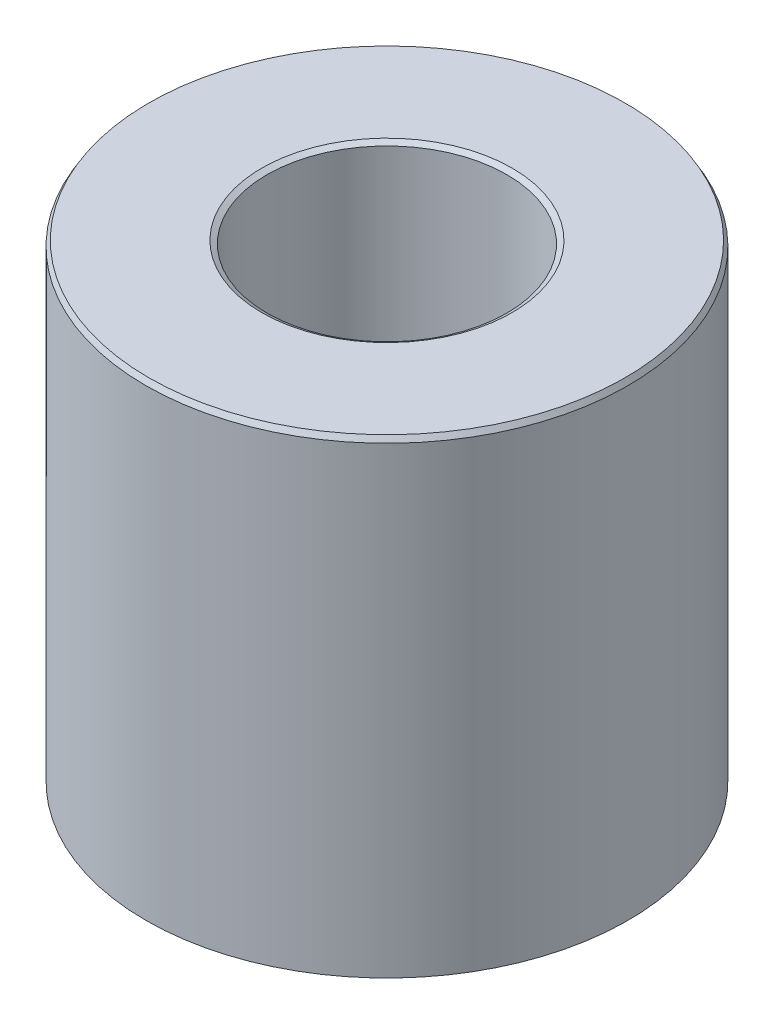
ISO-10303-21;
HEADER;
FILE_DESCRIPTION(('STEP AP214'),'2;1');
FILE_NAME('part.step','',(''),(''),'','','');
FILE_SCHEMA(('AUTOMOTIVE_DESIGN { 1 0 10303 214 1 1 1 1 }'));
ENDSEC;
DATA;
#1=APPLICATION_CONTEXT('core data for automotive mechanical design processes');
#2=APPLICATION_PROTOCOL_DEFINITION('international standard','automotive_design',2000,#1);
#3=PRODUCT_CONTEXT('',#1,'mechanical');
#4=PRODUCT('Part','Part','',(#3));
#5=PRODUCT_RELATED_PRODUCT_CATEGORY('part','',(#4));
#6=PRODUCT_DEFINITION_FORMATION('','',#4);
#7=PRODUCT_DEFINITION_CONTEXT('part definition',#1,'design');
#8=PRODUCT_DEFINITION('design','',#6,#7);
#9=PRODUCT_DEFINITION_SHAPE('','',#8);
#10=(LENGTH_UNIT() NAMED_UNIT(*) SI_UNIT(.MILLI.,.METRE.));
#11=(NAMED_UNIT(*) PLANE_ANGLE_UNIT() SI_UNIT($,.RADIAN.));
#12=(NAMED_UNIT(*) SI_UNIT($,.STERADIAN.) SOLID_ANGLE_UNIT());
#13=UNCERTAINTY_MEASURE_WITH_UNIT(LENGTH_MEASURE(1.E-05),#10,'distance_accuracy_value','');
#14=(GEOMETRIC_REPRESENTATION_CONTEXT(3) GLOBAL_UNCERTAINTY_ASSIGNED_CONTEXT((#13)) GLOBAL_UNIT_ASSIGNED_CONTEXT((#10,
#11,#12)) REPRESENTATION_CONTEXT('',''));
#15=CARTESIAN_POINT('',(0.,0.,0.));
#16=DIRECTION('',(0.,0.,1.));
#17=DIRECTION('',(1.,0.,0.));
#18=AXIS2_PLACEMENT_3D('',#15,#16,#17);
#19=CARTESIAN_POINT('',(0.,117.326546459103,0.));
#20=DIRECTION('',(0.,-1.,0.));
#21=DIRECTION('',(0.,0.,-1.));
#22=AXIS2_PLACEMENT_3D('',#19,#20,#21);
#23=CYLINDRICAL_SURFACE('',#22,60.);
#24=CARTESIAN_POINT('',(0.,0.756794460709628,0.));
#25=DIRECTION('',(0.,1.,0.));
#26=DIRECTION('',(0.,0.,1.));
#27=AXIS2_PLACEMENT_3D('',#24,#25,#26);
#28=CIRCLE('',#27,60.);
#29=CARTESIAN_POINT('',(0.,0.756794460709628,60.));
#30=VERTEX_POINT('',#29);
#31=EDGE_CURVE('E10',#30,#30,#28,.T.);
#32=ORIENTED_EDGE('',*,*,#31,.T.);
#33=EDGE_LOOP('',(#32));
#34=FACE_BOUND('',#33,.T.);
#35=CARTESIAN_POINT('',(0.,116.015740002267,0.));
#36=DIRECTION('',(0.,1.,0.));
#37=DIRECTION('',(0.,0.,1.));
#38=AXIS2_PLACEMENT_3D('',#35,#36,#37);
#39=CIRCLE('',#38,60.);
#40=CARTESIAN_POINT('',(0.,116.015740002267,60.));
#41=VERTEX_POINT('',#40);
#42=EDGE_CURVE('E50',#41,#41,#39,.F.);
#43=ORIENTED_EDGE('',*,*,#42,.T.);
#44=EDGE_LOOP('',(#43));
#45=FACE_BOUND('',#44,.T.);
#46=ADVANCED_FACE('F39',(#34,#45),#23,.T.);
#47=CARTESIAN_POINT('',(0.,117.326546459103,0.));
#48=DIRECTION('',(0.,1.,0.));
#49=DIRECTION('',(0.,0.,1.));
#50=AXIS2_PLACEMENT_3D('',#47,#48,#49);
#51=PLANE('',#50);
#52=CARTESIAN_POINT('',(0.,117.326546459103,0.));
#53=DIRECTION('',(0.,1.,0.));
#54=DIRECTION('',(0.,0.,1.));
#55=AXIS2_PLACEMENT_3D('',#52,#53,#54);
#56=CIRCLE('',#55,31.1596673048026);
#57=CARTESIAN_POINT('',(0.,117.326546459103,31.1596673048026));
#58=VERTEX_POINT('',#57);
#59=EDGE_CURVE('E58',#58,#58,#56,.F.);
#60=ORIENTED_EDGE('',*,*,#59,.T.);
#61=EDGE_LOOP('',(#60));
#62=FACE_BOUND('',#61,.T.);
#63=CARTESIAN_POINT('',(0.,117.326546459103,0.));
#64=DIRECTION('',(0.,1.,0.));
#65=DIRECTION('',(0.,0.,1.));
#66=AXIS2_PLACEMENT_3D('',#63,#64,#65);
#67=CIRCLE('',#66,59.2432055392903);
#68=CARTESIAN_POINT('',(0.,117.326546459103,59.2432055392903));
#69=VERTEX_POINT('',#68);
#70=EDGE_CURVE('E61',#69,#69,#67,.T.);
#71=ORIENTED_EDGE('',*,*,#70,.T.);
#72=EDGE_LOOP('',(#71));
#73=FACE_BOUND('',#72,.T.);
#74=ADVANCED_FACE('F88',(#62,#73),#51,.T.);
#75=CARTESIAN_POINT('',(0.,0.,0.));
#76=DIRECTION('',(0.,1.,0.));
#77=DIRECTION('',(0.,0.,1.));
#78=AXIS2_PLACEMENT_3D('',#75,#76,#77);
#79=PLANE('',#78);
#80=CARTESIAN_POINT('',(0.,0.,0.));
#81=DIRECTION('',(0.,1.,0.));
#82=DIRECTION('',(0.,0.,1.));
#83=AXIS2_PLACEMENT_3D('',#80,#81,#82);
#84=CIRCLE('',#83,30.6056553086764);
#85=CARTESIAN_POINT('',(0.,0.,30.6056553086764));
#86=VERTEX_POINT('',#85);
#87=EDGE_CURVE('E51',#86,#86,#84,.T.);
#88=ORIENTED_EDGE('',*,*,#87,.T.);
#89=EDGE_LOOP('',(#88));
#90=FACE_BOUND('',#89,.T.);
#91=CARTESIAN_POINT('',(0.,0.,0.));
#92=DIRECTION('',(0.,1.,0.));
#93=DIRECTION('',(0.,0.,1.));
#94=AXIS2_PLACEMENT_3D('',#91,#92,#93);
#95=CIRCLE('',#94,58.6891935431642);
#96=CARTESIAN_POINT('',(0.,0.,58.6891935431642));
#97=VERTEX_POINT('',#96);
#98=EDGE_CURVE('E54',#97,#97,#95,.F.);
#99=ORIENTED_EDGE('',*,*,#98,.T.);
#100=EDGE_LOOP('',(#99));
#101=FACE_BOUND('',#100,.T.);
#102=ADVANCED_FACE('F83',(#90,#101),#79,.F.);
#103=CARTESIAN_POINT('',(0.,117.326546459103,0.));
#104=DIRECTION('',(0.,-1.,0.));
#105=DIRECTION('',(0.,0.,-1.));
#106=AXIS2_PLACEMENT_3D('',#103,#104,#105);
#107=CYLINDRICAL_SURFACE('',#106,29.8488608479667);
#108=CARTESIAN_POINT('',(0.,116.569751998394,0.));
#109=DIRECTION('',(0.,1.,0.));
#110=DIRECTION('',(0.,0.,1.));
#111=AXIS2_PLACEMENT_3D('',#108,#109,#110);
#112=CIRCLE('',#111,29.8488608479667);
#113=CARTESIAN_POINT('',(0.,116.569751998394,29.8488608479667));
#114=VERTEX_POINT('',#113);
#115=EDGE_CURVE('E67',#114,#114,#112,.T.);
#116=ORIENTED_EDGE('',*,*,#115,.T.);
#117=EDGE_LOOP('',(#116));
#118=FACE_BOUND('',#117,.T.);
#119=CARTESIAN_POINT('',(0.,1.3108064568358,0.));
#120=DIRECTION('',(0.,1.,0.));
#121=DIRECTION('',(0.,0.,1.));
#122=AXIS2_PLACEMENT_3D('',#119,#120,#121);
#123=CIRCLE('',#122,29.8488608479667);
#124=CARTESIAN_POINT('',(0.,1.3108064568358,29.8488608479667));
#125=VERTEX_POINT('',#124);
#126=EDGE_CURVE('E69',#125,#125,#123,.F.);
#127=ORIENTED_EDGE('',*,*,#126,.T.);
#128=EDGE_LOOP('',(#127));
#129=FACE_BOUND('',#128,.T.);
#130=ADVANCED_FACE('F71',(#118,#129),#107,.F.);
#131=CARTESIAN_POINT('',(0.,116.569751998394,0.));
#132=DIRECTION('',(0.,1.,0.));
#133=DIRECTION('',(0.,0.,1.));
#134=AXIS2_PLACEMENT_3D('',#131,#132,#133);
#135=CONICAL_SURFACE('',#134,29.8488608479667,1.04719755119659);
#136=ORIENTED_EDGE('',*,*,#59,.F.);
#137=EDGE_LOOP('',(#136));
#138=FACE_BOUND('',#137,.T.);
#139=ORIENTED_EDGE('',*,*,#115,.F.);
#140=EDGE_LOOP('',(#139));
#141=FACE_BOUND('',#140,.T.);
#142=ADVANCED_FACE('F77',(#138,#141),#135,.F.);
#143=CARTESIAN_POINT('',(0.,0.,0.));
#144=DIRECTION('',(0.,-1.,0.));
#145=DIRECTION('',(0.,0.,-1.));
#146=AXIS2_PLACEMENT_3D('',#143,#144,#145);
#147=CONICAL_SURFACE('',#146,30.6056553086764,0.523598775598296);
#148=ORIENTED_EDGE('',*,*,#126,.F.);
#149=EDGE_LOOP('',(#148));
#150=FACE_BOUND('',#149,.T.);
#151=ORIENTED_EDGE('',*,*,#87,.F.);
#152=EDGE_LOOP('',(#151));
#153=FACE_BOUND('',#152,.T.);
#154=ADVANCED_FACE('F73',(#150,#153),#147,.F.);
#155=CARTESIAN_POINT('',(0.,0.756794460709628,0.));
#156=DIRECTION('',(0.,1.,0.));
#157=DIRECTION('',(0.,0.,1.));
#158=AXIS2_PLACEMENT_3D('',#155,#156,#157);
#159=CONICAL_SURFACE('',#158,60.,1.0471975511966);
#160=ORIENTED_EDGE('',*,*,#98,.F.);
#161=EDGE_LOOP('',(#160));
#162=FACE_BOUND('',#161,.T.);
#163=ORIENTED_EDGE('',*,*,#31,.F.);
#164=EDGE_LOOP('',(#163));
#165=FACE_BOUND('',#164,.T.);
#166=ADVANCED_FACE('F76',(#162,#165),#159,.T.);
#167=CARTESIAN_POINT('',(0.,117.326546459103,0.));
#168=DIRECTION('',(0.,-1.,0.));
#169=DIRECTION('',(0.,0.,-1.));
#170=AXIS2_PLACEMENT_3D('',#167,#168,#169);
#171=CONICAL_SURFACE('',#170,59.2432055392903,0.523598775598302);
#172=ORIENTED_EDGE('',*,*,#42,.F.);
#173=EDGE_LOOP('',(#172));
#174=FACE_BOUND('',#173,.T.);
#175=ORIENTED_EDGE('',*,*,#70,.F.);
#176=EDGE_LOOP('',(#175));
#177=FACE_BOUND('',#176,.T.);
#178=ADVANCED_FACE('F45',(#174,#177),#171,.T.);
#179=CLOSED_SHELL('',(#46,#74,#102,#130,#142,#154,#166,#178));
#180=MANIFOLD_SOLID_BREP('B2',#179);
#181=ADVANCED_BREP_SHAPE_REPRESENTATION('',(#18,#180),#14);
#182=SHAPE_DEFINITION_REPRESENTATION(#9,#181);
ENDSEC;
END-ISO-10303-21;
